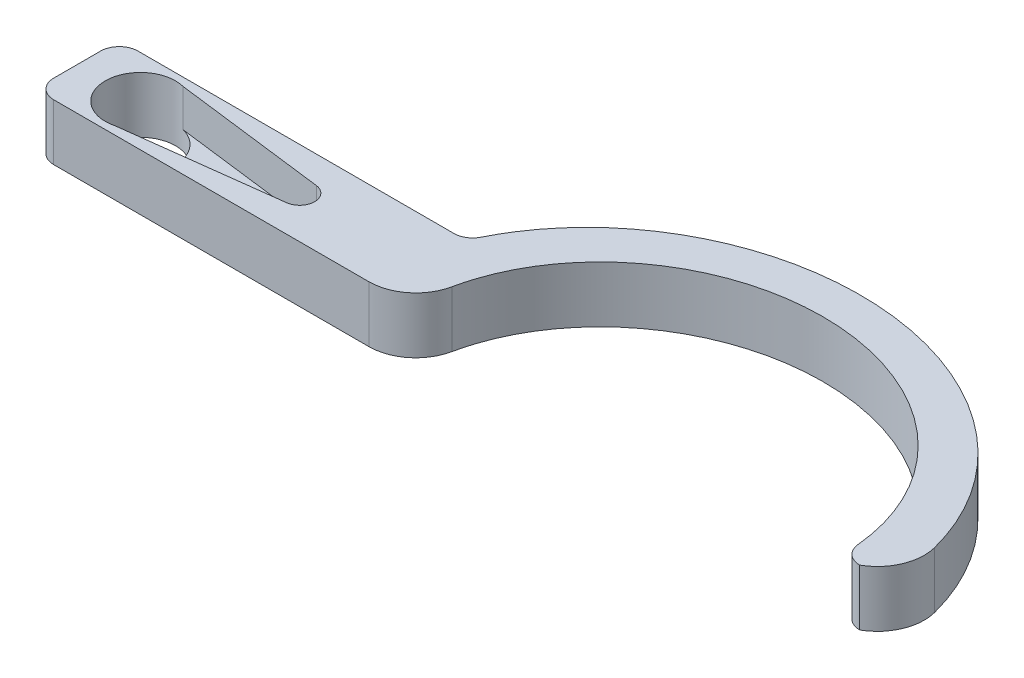
ISO-10303-21;
HEADER;
FILE_DESCRIPTION(('STEP AP214'),'2;1');
FILE_NAME('part.step','',(''),(''),'','','');
FILE_SCHEMA(('AUTOMOTIVE_DESIGN { 1 0 10303 214 1 1 1 1 }'));
ENDSEC;
DATA;
#1=APPLICATION_CONTEXT('core data for automotive mechanical design processes');
#2=APPLICATION_PROTOCOL_DEFINITION('international standard','automotive_design',2000,#1);
#3=PRODUCT_CONTEXT('',#1,'mechanical');
#4=PRODUCT('Part','Part','',(#3));
#5=PRODUCT_RELATED_PRODUCT_CATEGORY('part','',(#4));
#6=PRODUCT_DEFINITION_FORMATION('','',#4);
#7=PRODUCT_DEFINITION_CONTEXT('part definition',#1,'design');
#8=PRODUCT_DEFINITION('design','',#6,#7);
#9=PRODUCT_DEFINITION_SHAPE('','',#8);
#10=(LENGTH_UNIT() NAMED_UNIT(*) SI_UNIT(.MILLI.,.METRE.));
#11=(NAMED_UNIT(*) PLANE_ANGLE_UNIT() SI_UNIT($,.RADIAN.));
#12=(NAMED_UNIT(*) SI_UNIT($,.STERADIAN.) SOLID_ANGLE_UNIT());
#13=UNCERTAINTY_MEASURE_WITH_UNIT(LENGTH_MEASURE(1.E-05),#10,'distance_accuracy_value','');
#14=(GEOMETRIC_REPRESENTATION_CONTEXT(3) GLOBAL_UNCERTAINTY_ASSIGNED_CONTEXT((#13)) GLOBAL_UNIT_ASSIGNED_CONTEXT((#10,
#11,#12)) REPRESENTATION_CONTEXT('',''));
#15=CARTESIAN_POINT('',(0.,0.,0.));
#16=DIRECTION('',(0.,0.,1.));
#17=DIRECTION('',(1.,0.,0.));
#18=AXIS2_PLACEMENT_3D('',#15,#16,#17);
#19=CARTESIAN_POINT('',(0.,6.,4.5));
#20=DIRECTION('',(0.,0.,-1.));
#21=DIRECTION('',(-1.,0.,0.));
#22=AXIS2_PLACEMENT_3D('',#19,#20,#21);
#23=PLANE('',#22);
#24=DIRECTION('',(1.,0.,0.));
#25=VECTOR('',#24,1.);
#26=CARTESIAN_POINT('',(0.,0.,4.5));
#27=LINE('',#26,#25);
#28=CARTESIAN_POINT('',(-4.75,0.,4.5));
#29=VERTEX_POINT('',#28);
#30=CARTESIAN_POINT('',(28.894642136041,0.,4.5));
#31=VERTEX_POINT('',#30);
#32=EDGE_CURVE('E300',#29,#31,#27,.T.);
#33=ORIENTED_EDGE('',*,*,#32,.T.);
#34=DIRECTION('',(0.,1.,0.));
#35=VECTOR('',#34,1.);
#36=CARTESIAN_POINT('',(28.894642136041,6.,4.5));
#37=LINE('',#36,#35);
#38=CARTESIAN_POINT('',(28.894642136041,6.,4.5));
#39=VERTEX_POINT('',#38);
#40=EDGE_CURVE('E11',#31,#39,#37,.T.);
#41=ORIENTED_EDGE('',*,*,#40,.T.);
#42=DIRECTION('',(1.,0.,0.));
#43=VECTOR('',#42,1.);
#44=CARTESIAN_POINT('',(0.,6.,4.5));
#45=LINE('',#44,#43);
#46=CARTESIAN_POINT('',(-4.75,6.,4.5));
#47=VERTEX_POINT('',#46);
#48=EDGE_CURVE('E176',#47,#39,#45,.T.);
#49=ORIENTED_EDGE('',*,*,#48,.F.);
#50=DIRECTION('',(0.,-1.,0.));
#51=VECTOR('',#50,1.);
#52=CARTESIAN_POINT('',(-4.75,6.,4.5));
#53=LINE('',#52,#51);
#54=EDGE_CURVE('E253',#47,#29,#53,.T.);
#55=ORIENTED_EDGE('',*,*,#54,.T.);
#56=EDGE_LOOP('',(#33,#41,#49,#55));
#57=FACE_BOUND('',#56,.T.);
#58=ADVANCED_FACE('F36',(#57),#23,.F.);
#59=CARTESIAN_POINT('',(56.3726644889069,6.,4.5));
#60=DIRECTION('',(0.,1.,0.));
#61=DIRECTION('',(1.,0.,0.));
#62=AXIS2_PLACEMENT_3D('',#59,#60,#61);
#63=ELLIPSE('',#62,23.,21.);
#64=DIRECTION('',(0.,-1.,0.));
#65=VECTOR('',#64,1.);
#66=SURFACE_OF_LINEAR_EXTRUSION('',#63,#65);
#67=CARTESIAN_POINT('',(79.286958880521,6.,2.68878487158995));
#68=VERTEX_POINT('',#67);
#69=CARTESIAN_POINT('',(33.7871360412384,6.,0.531263006030345));
#70=VERTEX_POINT('',#69);
#71=EDGE_CURVE('E178',#68,#70,#63,.T.);
#72=ORIENTED_EDGE('',*,*,#71,.T.);
#73=DIRECTION('',(0.,-1.,0.));
#74=VECTOR('',#73,1.);
#75=CARTESIAN_POINT('',(33.7871360412384,6.,0.531263006030345));
#76=LINE('',#75,#74);
#77=CARTESIAN_POINT('',(33.7871360412384,0.,0.531263006030345));
#78=VERTEX_POINT('',#77);
#79=EDGE_CURVE('E44',#70,#78,#76,.T.);
#80=ORIENTED_EDGE('',*,*,#79,.T.);
#81=CARTESIAN_POINT('',(56.3726644889069,0.,4.5));
#82=DIRECTION('',(0.,1.,0.));
#83=DIRECTION('',(1.,0.,0.));
#84=AXIS2_PLACEMENT_3D('',#81,#82,#83);
#85=ELLIPSE('',#84,23.,21.);
#86=CARTESIAN_POINT('',(79.286958880521,0.,2.68878487158995));
#87=VERTEX_POINT('',#86);
#88=EDGE_CURVE('E297',#87,#78,#85,.T.);
#89=ORIENTED_EDGE('',*,*,#88,.F.);
#90=DIRECTION('',(0.,-1.,0.));
#91=VECTOR('',#90,1.);
#92=CARTESIAN_POINT('',(79.286958880521,0.,2.68878487158995));
#93=LINE('',#92,#91);
#94=EDGE_CURVE('E275',#87,#68,#93,.F.);
#95=ORIENTED_EDGE('',*,*,#94,.T.);
#96=EDGE_LOOP('',(#72,#80,#89,#95));
#97=FACE_BOUND('',#96,.T.);
#98=ADVANCED_FACE('F185',(#97),#66,.T.);
#99=CARTESIAN_POINT('',(56.3726644889069,6.,4.5));
#100=DIRECTION('',(0.,1.,0.));
#101=DIRECTION('',(1.,0.,0.));
#102=AXIS2_PLACEMENT_3D('',#99,#100,#101);
#103=ELLIPSE('',#102,28.,25.);
#104=DIRECTION('',(0.,-1.,0.));
#105=VECTOR('',#104,1.);
#106=SURFACE_OF_LINEAR_EXTRUSION('',#103,#105);
#107=CARTESIAN_POINT('',(83.6611586996226,6.,-1.10000709728005));
#108=VERTEX_POINT('',#107);
#109=CARTESIAN_POINT('',(30.765467491492,6.,-5.61223141149198));
#110=VERTEX_POINT('',#109);
#111=EDGE_CURVE('E181',#108,#110,#103,.T.);
#112=ORIENTED_EDGE('',*,*,#111,.F.);
#113=DIRECTION('',(0.,-1.,0.));
#114=VECTOR('',#113,1.);
#115=CARTESIAN_POINT('',(83.6611586996226,6.,-1.10000709728006));
#116=LINE('',#115,#114);
#117=CARTESIAN_POINT('',(83.6611586996226,0.,-1.10000709728005));
#118=VERTEX_POINT('',#117);
#119=EDGE_CURVE('E237',#108,#118,#116,.T.);
#120=ORIENTED_EDGE('',*,*,#119,.T.);
#121=CARTESIAN_POINT('',(56.3726644889069,0.,4.5));
#122=DIRECTION('',(0.,1.,0.));
#123=DIRECTION('',(1.,0.,0.));
#124=AXIS2_PLACEMENT_3D('',#121,#122,#123);
#125=ELLIPSE('',#124,28.,25.);
#126=CARTESIAN_POINT('',(30.765467491492,0.,-5.61223141149198));
#127=VERTEX_POINT('',#126);
#128=EDGE_CURVE('E295',#118,#127,#125,.T.);
#129=ORIENTED_EDGE('',*,*,#128,.T.);
#130=DIRECTION('',(0.,-1.,0.));
#131=VECTOR('',#130,1.);
#132=CARTESIAN_POINT('',(30.765467491492,0.,-5.61223141149198));
#133=LINE('',#132,#131);
#134=EDGE_CURVE('E261',#127,#110,#133,.F.);
#135=ORIENTED_EDGE('',*,*,#134,.T.);
#136=EDGE_LOOP('',(#112,#120,#129,#135));
#137=FACE_BOUND('',#136,.T.);
#138=ADVANCED_FACE('F189',(#137),#106,.F.);
#139=CARTESIAN_POINT('',(0.,6.,-4.5));
#140=DIRECTION('',(0.,0.,-1.));
#141=DIRECTION('',(-1.,0.,0.));
#142=AXIS2_PLACEMENT_3D('',#139,#140,#141);
#143=PLANE('',#142);
#144=DIRECTION('',(1.,0.,0.));
#145=VECTOR('',#144,1.);
#146=CARTESIAN_POINT('',(0.,6.,-4.5));
#147=LINE('',#146,#145);
#148=CARTESIAN_POINT('',(-4.75,6.,-4.5));
#149=VERTEX_POINT('',#148);
#150=CARTESIAN_POINT('',(28.973299270242,6.,-4.5));
#151=VERTEX_POINT('',#150);
#152=EDGE_CURVE('E307',#149,#151,#147,.T.);
#153=ORIENTED_EDGE('',*,*,#152,.T.);
#154=DIRECTION('',(0.,-1.,0.));
#155=VECTOR('',#154,1.);
#156=CARTESIAN_POINT('',(28.973299270242,6.,-4.5));
#157=LINE('',#156,#155);
#158=CARTESIAN_POINT('',(28.973299270242,0.,-4.5));
#159=VERTEX_POINT('',#158);
#160=EDGE_CURVE('E264',#151,#159,#157,.T.);
#161=ORIENTED_EDGE('',*,*,#160,.T.);
#162=DIRECTION('',(1.,0.,0.));
#163=VECTOR('',#162,1.);
#164=CARTESIAN_POINT('',(0.,0.,-4.5));
#165=LINE('',#164,#163);
#166=CARTESIAN_POINT('',(-4.75,0.,-4.5));
#167=VERTEX_POINT('',#166);
#168=EDGE_CURVE('E292',#167,#159,#165,.T.);
#169=ORIENTED_EDGE('',*,*,#168,.F.);
#170=DIRECTION('',(0.,-1.,0.));
#171=VECTOR('',#170,1.);
#172=CARTESIAN_POINT('',(-4.75,6.,-4.5));
#173=LINE('',#172,#171);
#174=EDGE_CURVE('E267',#167,#149,#173,.F.);
#175=ORIENTED_EDGE('',*,*,#174,.T.);
#176=EDGE_LOOP('',(#153,#161,#169,#175));
#177=FACE_BOUND('',#176,.T.);
#178=ADVANCED_FACE('F207',(#177),#143,.T.);
#179=CARTESIAN_POINT('',(17.,6.,0.));
#180=DIRECTION('',(0.,-1.,0.));
#181=DIRECTION('',(0.,0.,-1.));
#182=AXIS2_PLACEMENT_3D('',#179,#180,#181);
#183=CYLINDRICAL_SURFACE('',#182,1.6);
#184=CARTESIAN_POINT('',(17.,2.,0.));
#185=DIRECTION('',(0.,1.,0.));
#186=DIRECTION('',(0.,0.,1.));
#187=AXIS2_PLACEMENT_3D('',#184,#185,#186);
#188=CIRCLE('',#187,1.6);
#189=CARTESIAN_POINT('',(17.1995959499825,2.,1.5875016399206));
#190=VERTEX_POINT('',#189);
#191=CARTESIAN_POINT('',(17.1995959499825,2.,-1.5875016399206));
#192=VERTEX_POINT('',#191);
#193=EDGE_CURVE('E150',#190,#192,#188,.T.);
#194=ORIENTED_EDGE('',*,*,#193,.F.);
#195=DIRECTION('',(0.,-1.,0.));
#196=VECTOR('',#195,1.);
#197=CARTESIAN_POINT('',(17.1995959499825,6.,1.5875016399206));
#198=LINE('',#197,#196);
#199=CARTESIAN_POINT('',(17.1995959499825,6.,1.5875016399206));
#200=VERTEX_POINT('',#199);
#201=EDGE_CURVE('E144',#200,#190,#198,.T.);
#202=ORIENTED_EDGE('',*,*,#201,.F.);
#203=CARTESIAN_POINT('',(17.,6.,0.));
#204=DIRECTION('',(0.,1.,0.));
#205=DIRECTION('',(0.,0.,1.));
#206=AXIS2_PLACEMENT_3D('',#203,#204,#205);
#207=CIRCLE('',#206,1.6);
#208=CARTESIAN_POINT('',(17.1995959499825,6.,-1.5875016399206));
#209=VERTEX_POINT('',#208);
#210=EDGE_CURVE('E148',#200,#209,#207,.T.);
#211=ORIENTED_EDGE('',*,*,#210,.T.);
#212=DIRECTION('',(0.,-1.,0.));
#213=VECTOR('',#212,1.);
#214=CARTESIAN_POINT('',(17.1995959499825,6.,-1.5875016399206));
#215=LINE('',#214,#213);
#216=EDGE_CURVE('E287',#209,#192,#215,.T.);
#217=ORIENTED_EDGE('',*,*,#216,.T.);
#218=EDGE_LOOP('',(#194,#202,#211,#217));
#219=FACE_BOUND('',#218,.T.);
#220=ADVANCED_FACE('F146',(#219),#183,.F.);
#221=CARTESIAN_POINT('',(0.464148776248102,6.,3.691642758912));
#222=DIRECTION('',(-0.124747468739053,0.,-0.992188524950374));
#223=DIRECTION('',(-0.992188524950374,0.,0.124747468739053));
#224=AXIS2_PLACEMENT_3D('',#221,#222,#223);
#225=PLANE('',#224);
#226=DIRECTION('',(0.992188524950374,0.,-0.124747468739053));
#227=VECTOR('',#226,1.);
#228=CARTESIAN_POINT('',(0.464148776248102,2.,3.691642758912));
#229=LINE('',#228,#227);
#230=CARTESIAN_POINT('',(0.928297552496205,2.,3.63328551782399));
#231=VERTEX_POINT('',#230);
#232=EDGE_CURVE('E305',#231,#190,#229,.T.);
#233=ORIENTED_EDGE('',*,*,#232,.F.);
#234=DIRECTION('',(0.,-1.,0.));
#235=VECTOR('',#234,1.);
#236=CARTESIAN_POINT('',(0.928297552496205,6.,3.63328551782399));
#237=LINE('',#236,#235);
#238=CARTESIAN_POINT('',(0.928297552496205,6.,3.63328551782399));
#239=VERTEX_POINT('',#238);
#240=EDGE_CURVE('E155',#239,#231,#237,.T.);
#241=ORIENTED_EDGE('',*,*,#240,.F.);
#242=DIRECTION('',(0.992188524950374,0.,-0.124747468739053));
#243=VECTOR('',#242,1.);
#244=CARTESIAN_POINT('',(0.464148776248102,6.,3.691642758912));
#245=LINE('',#244,#243);
#246=EDGE_CURVE('E161',#239,#200,#245,.T.);
#247=ORIENTED_EDGE('',*,*,#246,.T.);
#248=ORIENTED_EDGE('',*,*,#201,.T.);
#249=EDGE_LOOP('',(#233,#241,#247,#248));
#250=FACE_BOUND('',#249,.T.);
#251=ADVANCED_FACE('F168',(#250),#225,.T.);
#252=CARTESIAN_POINT('',(0.,6.,0.));
#253=DIRECTION('',(0.,-1.,0.));
#254=DIRECTION('',(0.,0.,-1.));
#255=AXIS2_PLACEMENT_3D('',#252,#253,#254);
#256=CYLINDRICAL_SURFACE('',#255,3.75);
#257=ORIENTED_EDGE('',*,*,#240,.T.);
#258=CARTESIAN_POINT('',(0.,2.,0.));
#259=DIRECTION('',(0.,1.,0.));
#260=DIRECTION('',(0.,0.,1.));
#261=AXIS2_PLACEMENT_3D('',#258,#259,#260);
#262=CIRCLE('',#261,3.75);
#263=CARTESIAN_POINT('',(0.928297552496205,2.,-3.63328551782399));
#264=VERTEX_POINT('',#263);
#265=EDGE_CURVE('E470',#231,#264,#262,.T.);
#266=ORIENTED_EDGE('',*,*,#265,.T.);
#267=DIRECTION('',(0.,-1.,0.));
#268=VECTOR('',#267,1.);
#269=CARTESIAN_POINT('',(0.928297552496205,6.,-3.63328551782399));
#270=LINE('',#269,#268);
#271=CARTESIAN_POINT('',(0.928297552496205,6.,-3.63328551782399));
#272=VERTEX_POINT('',#271);
#273=EDGE_CURVE('E285',#272,#264,#270,.T.);
#274=ORIENTED_EDGE('',*,*,#273,.F.);
#275=CARTESIAN_POINT('',(0.,6.,0.));
#276=DIRECTION('',(0.,1.,0.));
#277=DIRECTION('',(0.,0.,1.));
#278=AXIS2_PLACEMENT_3D('',#275,#276,#277);
#279=CIRCLE('',#278,3.75);
#280=EDGE_CURVE('E170',#272,#239,#279,.T.);
#281=ORIENTED_EDGE('',*,*,#280,.T.);
#282=EDGE_LOOP('',(#257,#266,#274,#281));
#283=FACE_BOUND('',#282,.T.);
#284=CARTESIAN_POINT('',(0.,0.,0.));
#285=DIRECTION('',(0.,1.,0.));
#286=DIRECTION('',(0.,0.,1.));
#287=AXIS2_PLACEMENT_3D('',#284,#285,#286);
#288=CIRCLE('',#287,3.75);
#289=CARTESIAN_POINT('',(0.,0.,3.75));
#290=VERTEX_POINT('',#289);
#291=EDGE_CURVE('E302',#290,#290,#288,.T.);
#292=ORIENTED_EDGE('',*,*,#291,.F.);
#293=EDGE_LOOP('',(#292));
#294=FACE_BOUND('',#293,.T.);
#295=ADVANCED_FACE('F198',(#283,#294),#256,.F.);
#296=CARTESIAN_POINT('',(0.464148776248102,6.,-3.691642758912));
#297=DIRECTION('',(0.124747468739053,0.,-0.992188524950374));
#298=DIRECTION('',(-0.992188524950374,0.,-0.124747468739053));
#299=AXIS2_PLACEMENT_3D('',#296,#297,#298);
#300=PLANE('',#299);
#301=ORIENTED_EDGE('',*,*,#273,.T.);
#302=DIRECTION('',(0.992188524950374,0.,0.124747468739053));
#303=VECTOR('',#302,1.);
#304=CARTESIAN_POINT('',(0.464148776248102,2.,-3.691642758912));
#305=LINE('',#304,#303);
#306=EDGE_CURVE('E471',#264,#192,#305,.T.);
#307=ORIENTED_EDGE('',*,*,#306,.T.);
#308=ORIENTED_EDGE('',*,*,#216,.F.);
#309=DIRECTION('',(0.992188524950374,0.,0.124747468739053));
#310=VECTOR('',#309,1.);
#311=CARTESIAN_POINT('',(0.464148776248102,6.,-3.691642758912));
#312=LINE('',#311,#310);
#313=EDGE_CURVE('E164',#272,#209,#312,.T.);
#314=ORIENTED_EDGE('',*,*,#313,.F.);
#315=EDGE_LOOP('',(#301,#307,#308,#314));
#316=FACE_BOUND('',#315,.T.);
#317=ADVANCED_FACE('F194',(#316),#300,.F.);
#318=CARTESIAN_POINT('',(-6.75,6.,0.));
#319=DIRECTION('',(1.,0.,0.));
#320=DIRECTION('',(0.,0.,-1.));
#321=AXIS2_PLACEMENT_3D('',#318,#319,#320);
#322=PLANE('',#321);
#323=DIRECTION('',(0.,0.,1.));
#324=VECTOR('',#323,1.);
#325=CARTESIAN_POINT('',(-6.75,6.,0.));
#326=LINE('',#325,#324);
#327=CARTESIAN_POINT('',(-6.75,6.,-2.5));
#328=VERTEX_POINT('',#327);
#329=CARTESIAN_POINT('',(-6.75,6.,2.5));
#330=VERTEX_POINT('',#329);
#331=EDGE_CURVE('E289',#328,#330,#326,.T.);
#332=ORIENTED_EDGE('',*,*,#331,.F.);
#333=DIRECTION('',(0.,-1.,0.));
#334=VECTOR('',#333,1.);
#335=CARTESIAN_POINT('',(-6.75,0.,-2.5));
#336=LINE('',#335,#334);
#337=CARTESIAN_POINT('',(-6.75,0.,-2.5));
#338=VERTEX_POINT('',#337);
#339=EDGE_CURVE('E256',#328,#338,#336,.T.);
#340=ORIENTED_EDGE('',*,*,#339,.T.);
#341=DIRECTION('',(0.,0.,1.));
#342=VECTOR('',#341,1.);
#343=CARTESIAN_POINT('',(-6.75,0.,0.));
#344=LINE('',#343,#342);
#345=CARTESIAN_POINT('',(-6.75,0.,2.5));
#346=VERTEX_POINT('',#345);
#347=EDGE_CURVE('E166',#338,#346,#344,.T.);
#348=ORIENTED_EDGE('',*,*,#347,.T.);
#349=DIRECTION('',(0.,-1.,0.));
#350=VECTOR('',#349,1.);
#351=CARTESIAN_POINT('',(-6.75,6.,2.5));
#352=LINE('',#351,#350);
#353=EDGE_CURVE('E259',#346,#330,#352,.F.);
#354=ORIENTED_EDGE('',*,*,#353,.T.);
#355=EDGE_LOOP('',(#332,#340,#348,#354));
#356=FACE_BOUND('',#355,.T.);
#357=ADVANCED_FACE('F197',(#356),#322,.F.);
#358=CARTESIAN_POINT('',(0.,6.,0.));
#359=DIRECTION('',(0.,1.,0.));
#360=DIRECTION('',(0.,0.,1.));
#361=AXIS2_PLACEMENT_3D('',#358,#359,#360);
#362=PLANE('',#361);
#363=ORIENTED_EDGE('',*,*,#210,.F.);
#364=ORIENTED_EDGE('',*,*,#246,.F.);
#365=ORIENTED_EDGE('',*,*,#280,.F.);
#366=ORIENTED_EDGE('',*,*,#313,.T.);
#367=EDGE_LOOP('',(#363,#364,#365,#366));
#368=FACE_BOUND('',#367,.T.);
#369=CARTESIAN_POINT('',(81.278029012952,6.,2.5));
#370=DIRECTION('',(0.,1.,0.));
#371=DIRECTION('',(0.,0.,1.));
#372=AXIS2_PLACEMENT_3D('',#369,#370,#371);
#373=CIRCLE('',#372,2.);
#374=CARTESIAN_POINT('',(81.278029012952,6.,4.5));
#375=VERTEX_POINT('',#374);
#376=EDGE_CURVE('E269',#68,#375,#373,.T.);
#377=ORIENTED_EDGE('',*,*,#376,.T.);
#378=CARTESIAN_POINT('',(78.8190197906105,6.,0.146464236457974));
#379=DIRECTION('',(0.,1.,0.));
#380=DIRECTION('',(0.,0.,1.));
#381=AXIS2_PLACEMENT_3D('',#378,#379,#380);
#382=CIRCLE('',#381,5.);
#383=EDGE_CURVE('E234',#375,#108,#382,.T.);
#384=ORIENTED_EDGE('',*,*,#383,.T.);
#385=ORIENTED_EDGE('',*,*,#111,.T.);
#386=CARTESIAN_POINT('',(28.973299270242,6.,-6.49999999999999));
#387=DIRECTION('',(0.,1.,0.));
#388=DIRECTION('',(0.,0.,1.));
#389=AXIS2_PLACEMENT_3D('',#386,#387,#388);
#390=CIRCLE('',#389,2.);
#391=EDGE_CURVE('E248',#110,#151,#390,.F.);
#392=ORIENTED_EDGE('',*,*,#391,.T.);
#393=ORIENTED_EDGE('',*,*,#152,.F.);
#394=CARTESIAN_POINT('',(-4.75,6.,-2.5));
#395=DIRECTION('',(0.,1.,0.));
#396=DIRECTION('',(0.,0.,1.));
#397=AXIS2_PLACEMENT_3D('',#394,#395,#396);
#398=CIRCLE('',#397,2.);
#399=EDGE_CURVE('E271',#149,#328,#398,.T.);
#400=ORIENTED_EDGE('',*,*,#399,.T.);
#401=ORIENTED_EDGE('',*,*,#331,.T.);
#402=CARTESIAN_POINT('',(-4.75,6.,2.5));
#403=DIRECTION('',(0.,1.,0.));
#404=DIRECTION('',(0.,0.,1.));
#405=AXIS2_PLACEMENT_3D('',#402,#403,#404);
#406=CIRCLE('',#405,2.);
#407=EDGE_CURVE('E273',#330,#47,#406,.T.);
#408=ORIENTED_EDGE('',*,*,#407,.T.);
#409=ORIENTED_EDGE('',*,*,#48,.T.);
#410=CARTESIAN_POINT('',(28.894642136041,6.,-0.5));
#411=DIRECTION('',(0.,1.,0.));
#412=DIRECTION('',(0.,0.,1.));
#413=AXIS2_PLACEMENT_3D('',#410,#411,#412);
#414=CIRCLE('',#413,5.);
#415=EDGE_CURVE('E56',#39,#70,#414,.T.);
#416=ORIENTED_EDGE('',*,*,#415,.T.);
#417=ORIENTED_EDGE('',*,*,#71,.F.);
#418=EDGE_LOOP('',(#377,#384,#385,#392,#393,#400,#401,#408,#409,#416,#417));
#419=FACE_BOUND('',#418,.T.);
#420=ADVANCED_FACE('F159',(#368,#419),#362,.T.);
#421=CARTESIAN_POINT('',(0.,0.,0.));
#422=DIRECTION('',(0.,1.,0.));
#423=DIRECTION('',(0.,0.,1.));
#424=AXIS2_PLACEMENT_3D('',#421,#422,#423);
#425=PLANE('',#424);
#426=ORIENTED_EDGE('',*,*,#128,.F.);
#427=CARTESIAN_POINT('',(78.8190197906105,0.,0.146464236457974));
#428=DIRECTION('',(0.,1.,0.));
#429=DIRECTION('',(0.,0.,1.));
#430=AXIS2_PLACEMENT_3D('',#427,#428,#429);
#431=CIRCLE('',#430,5.);
#432=CARTESIAN_POINT('',(81.278029012952,0.,4.5));
#433=VERTEX_POINT('',#432);
#434=EDGE_CURVE('E241',#118,#433,#431,.F.);
#435=ORIENTED_EDGE('',*,*,#434,.T.);
#436=CARTESIAN_POINT('',(81.278029012952,0.,2.5));
#437=DIRECTION('',(0.,1.,0.));
#438=DIRECTION('',(0.,0.,1.));
#439=AXIS2_PLACEMENT_3D('',#436,#437,#438);
#440=CIRCLE('',#439,2.);
#441=EDGE_CURVE('E277',#433,#87,#440,.F.);
#442=ORIENTED_EDGE('',*,*,#441,.T.);
#443=ORIENTED_EDGE('',*,*,#88,.T.);
#444=CARTESIAN_POINT('',(28.894642136041,0.,-0.5));
#445=DIRECTION('',(0.,1.,0.));
#446=DIRECTION('',(0.,0.,1.));
#447=AXIS2_PLACEMENT_3D('',#444,#445,#446);
#448=CIRCLE('',#447,5.);
#449=EDGE_CURVE('E245',#78,#31,#448,.F.);
#450=ORIENTED_EDGE('',*,*,#449,.T.);
#451=ORIENTED_EDGE('',*,*,#32,.F.);
#452=CARTESIAN_POINT('',(-4.75,0.,2.5));
#453=DIRECTION('',(0.,1.,0.));
#454=DIRECTION('',(0.,0.,1.));
#455=AXIS2_PLACEMENT_3D('',#452,#453,#454);
#456=CIRCLE('',#455,2.);
#457=EDGE_CURVE('E281',#29,#346,#456,.F.);
#458=ORIENTED_EDGE('',*,*,#457,.T.);
#459=ORIENTED_EDGE('',*,*,#347,.F.);
#460=CARTESIAN_POINT('',(-4.75,0.,-2.5));
#461=DIRECTION('',(0.,1.,0.));
#462=DIRECTION('',(0.,0.,1.));
#463=AXIS2_PLACEMENT_3D('',#460,#461,#462);
#464=CIRCLE('',#463,2.);
#465=EDGE_CURVE('E279',#338,#167,#464,.F.);
#466=ORIENTED_EDGE('',*,*,#465,.T.);
#467=ORIENTED_EDGE('',*,*,#168,.T.);
#468=CARTESIAN_POINT('',(28.973299270242,0.,-6.49999999999999));
#469=DIRECTION('',(0.,1.,0.));
#470=DIRECTION('',(0.,0.,1.));
#471=AXIS2_PLACEMENT_3D('',#468,#469,#470);
#472=CIRCLE('',#471,2.);
#473=EDGE_CURVE('E250',#159,#127,#472,.T.);
#474=ORIENTED_EDGE('',*,*,#473,.T.);
#475=EDGE_LOOP('',(#426,#435,#442,#443,#450,#451,#458,#459,#466,#467,#474));
#476=FACE_BOUND('',#475,.T.);
#477=ORIENTED_EDGE('',*,*,#291,.T.);
#478=EDGE_LOOP('',(#477));
#479=FACE_BOUND('',#478,.T.);
#480=ADVANCED_FACE('F319',(#476,#479),#425,.F.);
#481=CARTESIAN_POINT('',(0.,2.,0.));
#482=DIRECTION('',(0.,1.,0.));
#483=DIRECTION('',(0.,0.,1.));
#484=AXIS2_PLACEMENT_3D('',#481,#482,#483);
#485=PLANE('',#484);
#486=ORIENTED_EDGE('',*,*,#265,.F.);
#487=ORIENTED_EDGE('',*,*,#232,.T.);
#488=ORIENTED_EDGE('',*,*,#193,.T.);
#489=ORIENTED_EDGE('',*,*,#306,.F.);
#490=EDGE_LOOP('',(#486,#487,#488,#489));
#491=FACE_BOUND('',#490,.T.);
#492=ADVANCED_FACE('F212',(#491),#485,.T.);
#493=CARTESIAN_POINT('',(81.278029012952,3.,2.5));
#494=DIRECTION('',(0.,-1.,0.));
#495=DIRECTION('',(0.,0.,-1.));
#496=AXIS2_PLACEMENT_3D('',#493,#494,#495);
#497=CYLINDRICAL_SURFACE('',#496,2.);
#498=ORIENTED_EDGE('',*,*,#376,.F.);
#499=ORIENTED_EDGE('',*,*,#94,.F.);
#500=ORIENTED_EDGE('',*,*,#441,.F.);
#501=DIRECTION('',(0.,1.,0.));
#502=VECTOR('',#501,1.);
#503=CARTESIAN_POINT('',(81.278029012952,0.,4.5));
#504=LINE('',#503,#502);
#505=EDGE_CURVE('E154',#375,#433,#504,.F.);
#506=ORIENTED_EDGE('',*,*,#505,.F.);
#507=EDGE_LOOP('',(#498,#499,#500,#506));
#508=FACE_BOUND('',#507,.T.);
#509=ADVANCED_FACE('F208',(#508),#497,.T.);
#510=CARTESIAN_POINT('',(28.973299270242,3.,-6.49999999999999));
#511=DIRECTION('',(0.,-1.,0.));
#512=DIRECTION('',(0.,0.,-1.));
#513=AXIS2_PLACEMENT_3D('',#510,#511,#512);
#514=CYLINDRICAL_SURFACE('',#513,2.);
#515=ORIENTED_EDGE('',*,*,#391,.F.);
#516=ORIENTED_EDGE('',*,*,#134,.F.);
#517=ORIENTED_EDGE('',*,*,#473,.F.);
#518=ORIENTED_EDGE('',*,*,#160,.F.);
#519=EDGE_LOOP('',(#515,#516,#517,#518));
#520=FACE_BOUND('',#519,.T.);
#521=ADVANCED_FACE('F211',(#520),#514,.F.);
#522=CARTESIAN_POINT('',(-4.75,6.,-2.5));
#523=DIRECTION('',(0.,1.,0.));
#524=DIRECTION('',(0.,0.,1.));
#525=AXIS2_PLACEMENT_3D('',#522,#523,#524);
#526=CYLINDRICAL_SURFACE('',#525,2.);
#527=ORIENTED_EDGE('',*,*,#399,.F.);
#528=ORIENTED_EDGE('',*,*,#174,.F.);
#529=ORIENTED_EDGE('',*,*,#465,.F.);
#530=ORIENTED_EDGE('',*,*,#339,.F.);
#531=EDGE_LOOP('',(#527,#528,#529,#530));
#532=FACE_BOUND('',#531,.T.);
#533=ADVANCED_FACE('F216',(#532),#526,.T.);
#534=CARTESIAN_POINT('',(-4.75,6.,2.5));
#535=DIRECTION('',(0.,-1.,0.));
#536=DIRECTION('',(0.,0.,-1.));
#537=AXIS2_PLACEMENT_3D('',#534,#535,#536);
#538=CYLINDRICAL_SURFACE('',#537,2.);
#539=ORIENTED_EDGE('',*,*,#407,.F.);
#540=ORIENTED_EDGE('',*,*,#353,.F.);
#541=ORIENTED_EDGE('',*,*,#457,.F.);
#542=ORIENTED_EDGE('',*,*,#54,.F.);
#543=EDGE_LOOP('',(#539,#540,#541,#542));
#544=FACE_BOUND('',#543,.T.);
#545=ADVANCED_FACE('F220',(#544),#538,.T.);
#546=CARTESIAN_POINT('',(78.8190197906105,3.,0.146464236457974));
#547=DIRECTION('',(0.,-1.,0.));
#548=DIRECTION('',(0.,0.,-1.));
#549=AXIS2_PLACEMENT_3D('',#546,#547,#548);
#550=CYLINDRICAL_SURFACE('',#549,5.);
#551=ORIENTED_EDGE('',*,*,#383,.F.);
#552=ORIENTED_EDGE('',*,*,#505,.T.);
#553=ORIENTED_EDGE('',*,*,#434,.F.);
#554=ORIENTED_EDGE('',*,*,#119,.F.);
#555=EDGE_LOOP('',(#551,#552,#553,#554));
#556=FACE_BOUND('',#555,.T.);
#557=ADVANCED_FACE('F223',(#556),#550,.T.);
#558=CARTESIAN_POINT('',(28.894642136041,3.,-0.5));
#559=DIRECTION('',(0.,-1.,0.));
#560=DIRECTION('',(0.,0.,-1.));
#561=AXIS2_PLACEMENT_3D('',#558,#559,#560);
#562=CYLINDRICAL_SURFACE('',#561,5.);
#563=ORIENTED_EDGE('',*,*,#415,.F.);
#564=ORIENTED_EDGE('',*,*,#40,.F.);
#565=ORIENTED_EDGE('',*,*,#449,.F.);
#566=ORIENTED_EDGE('',*,*,#79,.F.);
#567=EDGE_LOOP('',(#563,#564,#565,#566));
#568=FACE_BOUND('',#567,.T.);
#569=ADVANCED_FACE('F38',(#568),#562,.T.);
#570=CLOSED_SHELL('',(#58,#98,#138,#178,#220,#251,#295,#317,#357,#420,#480,#492,#509,#521,#533,
#545,#557,#569));
#571=MANIFOLD_SOLID_BREP('B2',#570);
#572=ADVANCED_BREP_SHAPE_REPRESENTATION('',(#18,#571),#14);
#573=SHAPE_DEFINITION_REPRESENTATION(#9,#572);
ENDSEC;
END-ISO-10303-21;
